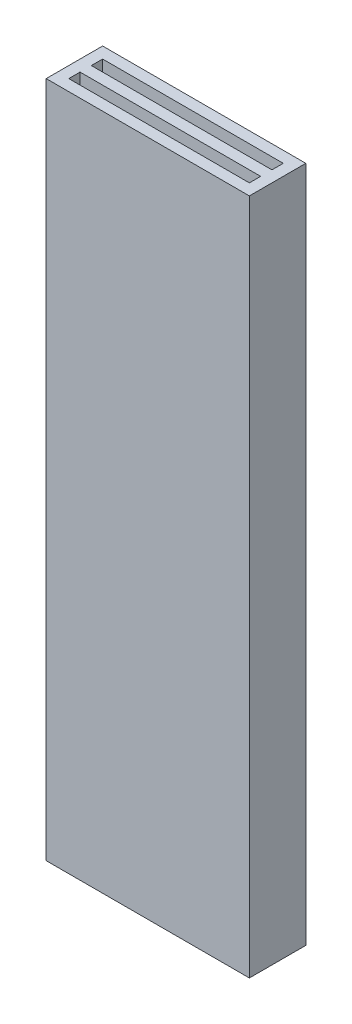
ISO-10303-21;
HEADER;
FILE_DESCRIPTION(('STEP AP214'),'2;1');
FILE_NAME('part.step','',(''),(''),'','','');
FILE_SCHEMA(('AUTOMOTIVE_DESIGN { 1 0 10303 214 1 1 1 1 }'));
ENDSEC;
DATA;
#1=APPLICATION_CONTEXT('core data for automotive mechanical design processes');
#2=APPLICATION_PROTOCOL_DEFINITION('international standard','automotive_design',2000,#1);
#3=PRODUCT_CONTEXT('',#1,'mechanical');
#4=PRODUCT('Part','Part','',(#3));
#5=PRODUCT_RELATED_PRODUCT_CATEGORY('part','',(#4));
#6=PRODUCT_DEFINITION_FORMATION('','',#4);
#7=PRODUCT_DEFINITION_CONTEXT('part definition',#1,'design');
#8=PRODUCT_DEFINITION('design','',#6,#7);
#9=PRODUCT_DEFINITION_SHAPE('','',#8);
#10=(LENGTH_UNIT() NAMED_UNIT(*) SI_UNIT(.MILLI.,.METRE.));
#11=(NAMED_UNIT(*) PLANE_ANGLE_UNIT() SI_UNIT($,.RADIAN.));
#12=(NAMED_UNIT(*) SI_UNIT($,.STERADIAN.) SOLID_ANGLE_UNIT());
#13=UNCERTAINTY_MEASURE_WITH_UNIT(LENGTH_MEASURE(1.E-05),#10,'distance_accuracy_value','');
#14=(GEOMETRIC_REPRESENTATION_CONTEXT(3) GLOBAL_UNCERTAINTY_ASSIGNED_CONTEXT((#13)) GLOBAL_UNIT_ASSIGNED_CONTEXT((#10,
#11,#12)) REPRESENTATION_CONTEXT('',''));
#15=CARTESIAN_POINT('',(0.,0.,0.));
#16=DIRECTION('',(0.,0.,1.));
#17=DIRECTION('',(1.,0.,0.));
#18=AXIS2_PLACEMENT_3D('',#15,#16,#17);
#19=CARTESIAN_POINT('',(0.,15.,0.));
#20=DIRECTION('',(0.,-1.,0.));
#21=DIRECTION('',(0.,0.,-1.));
#22=AXIS2_PLACEMENT_3D('',#19,#20,#21);
#23=PLANE('',#22);
#24=DIRECTION('',(0.,0.,-1.));
#25=VECTOR('',#24,1.);
#26=CARTESIAN_POINT('',(4.5,15.,1.25));
#27=LINE('',#26,#25);
#28=CARTESIAN_POINT('',(4.5,15.,1.25));
#29=VERTEX_POINT('',#28);
#30=CARTESIAN_POINT('',(4.5,15.,-1.25));
#31=VERTEX_POINT('',#30);
#32=EDGE_CURVE('E222',#29,#31,#27,.T.);
#33=ORIENTED_EDGE('',*,*,#32,.T.);
#34=DIRECTION('',(-1.,0.,0.));
#35=VECTOR('',#34,1.);
#36=CARTESIAN_POINT('',(-4.5,15.,-1.25));
#37=LINE('',#36,#35);
#38=CARTESIAN_POINT('',(-4.5,15.,-1.25));
#39=VERTEX_POINT('',#38);
#40=EDGE_CURVE('E226',#31,#39,#37,.T.);
#41=ORIENTED_EDGE('',*,*,#40,.T.);
#42=DIRECTION('',(0.,0.,1.));
#43=VECTOR('',#42,1.);
#44=CARTESIAN_POINT('',(-4.5,15.,1.25));
#45=LINE('',#44,#43);
#46=CARTESIAN_POINT('',(-4.5,15.,1.25));
#47=VERTEX_POINT('',#46);
#48=EDGE_CURVE('E230',#39,#47,#45,.T.);
#49=ORIENTED_EDGE('',*,*,#48,.T.);
#50=DIRECTION('',(1.,0.,0.));
#51=VECTOR('',#50,1.);
#52=CARTESIAN_POINT('',(-4.5,15.,1.25));
#53=LINE('',#52,#51);
#54=EDGE_CURVE('E233',#47,#29,#53,.T.);
#55=ORIENTED_EDGE('',*,*,#54,.T.);
#56=EDGE_LOOP('',(#33,#41,#49,#55));
#57=FACE_BOUND('',#56,.T.);
#58=DIRECTION('',(1.,0.,0.));
#59=VECTOR('',#58,1.);
#60=CARTESIAN_POINT('',(0.,15.,-0.75));
#61=LINE('',#60,#59);
#62=CARTESIAN_POINT('',(-4.,15.,-0.75));
#63=VERTEX_POINT('',#62);
#64=CARTESIAN_POINT('',(4.,15.,-0.75));
#65=VERTEX_POINT('',#64);
#66=EDGE_CURVE('E195',#63,#65,#61,.T.);
#67=ORIENTED_EDGE('',*,*,#66,.T.);
#68=DIRECTION('',(0.,0.,1.));
#69=VECTOR('',#68,1.);
#70=CARTESIAN_POINT('',(4.,15.,0.));
#71=LINE('',#70,#69);
#72=CARTESIAN_POINT('',(4.,15.,-0.25));
#73=VERTEX_POINT('',#72);
#74=EDGE_CURVE('E217',#65,#73,#71,.T.);
#75=ORIENTED_EDGE('',*,*,#74,.T.);
#76=DIRECTION('',(-1.,0.,0.));
#77=VECTOR('',#76,1.);
#78=CARTESIAN_POINT('',(0.,15.,-0.25));
#79=LINE('',#78,#77);
#80=CARTESIAN_POINT('',(-4.,15.,-0.25));
#81=VERTEX_POINT('',#80);
#82=EDGE_CURVE('E213',#73,#81,#79,.T.);
#83=ORIENTED_EDGE('',*,*,#82,.T.);
#84=DIRECTION('',(0.,0.,-1.));
#85=VECTOR('',#84,1.);
#86=CARTESIAN_POINT('',(-4.,15.,0.));
#87=LINE('',#86,#85);
#88=EDGE_CURVE('E209',#81,#63,#87,.T.);
#89=ORIENTED_EDGE('',*,*,#88,.T.);
#90=EDGE_LOOP('',(#67,#75,#83,#89));
#91=FACE_BOUND('',#90,.T.);
#92=DIRECTION('',(0.,0.,-1.));
#93=VECTOR('',#92,1.);
#94=CARTESIAN_POINT('',(4.,15.,0.));
#95=LINE('',#94,#93);
#96=CARTESIAN_POINT('',(4.,15.,0.75));
#97=VERTEX_POINT('',#96);
#98=CARTESIAN_POINT('',(4.,15.,0.25));
#99=VERTEX_POINT('',#98);
#100=EDGE_CURVE('E140',#97,#99,#95,.T.);
#101=ORIENTED_EDGE('',*,*,#100,.F.);
#102=DIRECTION('',(1.,0.,0.));
#103=VECTOR('',#102,1.);
#104=CARTESIAN_POINT('',(0.,15.,0.75));
#105=LINE('',#104,#103);
#106=CARTESIAN_POINT('',(-4.,15.,0.75));
#107=VERTEX_POINT('',#106);
#108=EDGE_CURVE('E169',#107,#97,#105,.T.);
#109=ORIENTED_EDGE('',*,*,#108,.F.);
#110=DIRECTION('',(0.,0.,1.));
#111=VECTOR('',#110,1.);
#112=CARTESIAN_POINT('',(-4.,15.,0.));
#113=LINE('',#112,#111);
#114=CARTESIAN_POINT('',(-4.,15.,0.25));
#115=VERTEX_POINT('',#114);
#116=EDGE_CURVE('E166',#115,#107,#113,.T.);
#117=ORIENTED_EDGE('',*,*,#116,.F.);
#118=DIRECTION('',(-1.,0.,0.));
#119=VECTOR('',#118,1.);
#120=CARTESIAN_POINT('',(0.,15.,0.25));
#121=LINE('',#120,#119);
#122=EDGE_CURVE('E157',#99,#115,#121,.T.);
#123=ORIENTED_EDGE('',*,*,#122,.F.);
#124=EDGE_LOOP('',(#101,#109,#117,#123));
#125=FACE_BOUND('',#124,.T.);
#126=ADVANCED_FACE('F39',(#57,#91,#125),#23,.F.);
#127=CARTESIAN_POINT('',(0.,-15.,0.));
#128=DIRECTION('',(0.,-1.,0.));
#129=DIRECTION('',(0.,0.,-1.));
#130=AXIS2_PLACEMENT_3D('',#127,#128,#129);
#131=PLANE('',#130);
#132=DIRECTION('',(0.,0.,-1.));
#133=VECTOR('',#132,1.);
#134=CARTESIAN_POINT('',(4.,-15.,-0.25));
#135=LINE('',#134,#133);
#136=CARTESIAN_POINT('',(4.,-15.,-0.25));
#137=VERTEX_POINT('',#136);
#138=CARTESIAN_POINT('',(4.,-15.,-0.75));
#139=VERTEX_POINT('',#138);
#140=EDGE_CURVE('E174',#137,#139,#135,.T.);
#141=ORIENTED_EDGE('',*,*,#140,.T.);
#142=DIRECTION('',(-1.,0.,0.));
#143=VECTOR('',#142,1.);
#144=CARTESIAN_POINT('',(-4.,-15.,-0.75));
#145=LINE('',#144,#143);
#146=CARTESIAN_POINT('',(-4.,-15.,-0.75));
#147=VERTEX_POINT('',#146);
#148=EDGE_CURVE('E178',#139,#147,#145,.T.);
#149=ORIENTED_EDGE('',*,*,#148,.T.);
#150=DIRECTION('',(0.,0.,1.));
#151=VECTOR('',#150,1.);
#152=CARTESIAN_POINT('',(-4.,-15.,-0.25));
#153=LINE('',#152,#151);
#154=CARTESIAN_POINT('',(-4.,-15.,-0.25));
#155=VERTEX_POINT('',#154);
#156=EDGE_CURVE('E182',#147,#155,#153,.T.);
#157=ORIENTED_EDGE('',*,*,#156,.T.);
#158=DIRECTION('',(1.,0.,0.));
#159=VECTOR('',#158,1.);
#160=CARTESIAN_POINT('',(-4.,-15.,-0.25));
#161=LINE('',#160,#159);
#162=EDGE_CURVE('E186',#155,#137,#161,.T.);
#163=ORIENTED_EDGE('',*,*,#162,.T.);
#164=EDGE_LOOP('',(#141,#149,#157,#163));
#165=FACE_BOUND('',#164,.T.);
#166=DIRECTION('',(0.,0.,-1.));
#167=VECTOR('',#166,1.);
#168=CARTESIAN_POINT('',(4.5,-15.,1.25));
#169=LINE('',#168,#167);
#170=CARTESIAN_POINT('',(4.5,-15.,1.25));
#171=VERTEX_POINT('',#170);
#172=CARTESIAN_POINT('',(4.5,-15.,-1.25));
#173=VERTEX_POINT('',#172);
#174=EDGE_CURVE('E221',#171,#173,#169,.T.);
#175=ORIENTED_EDGE('',*,*,#174,.F.);
#176=DIRECTION('',(1.,0.,0.));
#177=VECTOR('',#176,1.);
#178=CARTESIAN_POINT('',(-4.5,-15.,1.25));
#179=LINE('',#178,#177);
#180=CARTESIAN_POINT('',(-4.5,-15.,1.25));
#181=VERTEX_POINT('',#180);
#182=EDGE_CURVE('E227',#181,#171,#179,.T.);
#183=ORIENTED_EDGE('',*,*,#182,.F.);
#184=DIRECTION('',(0.,0.,1.));
#185=VECTOR('',#184,1.);
#186=CARTESIAN_POINT('',(-4.5,-15.,1.25));
#187=LINE('',#186,#185);
#188=CARTESIAN_POINT('',(-4.5,-15.,-1.25));
#189=VERTEX_POINT('',#188);
#190=EDGE_CURVE('E243',#189,#181,#187,.T.);
#191=ORIENTED_EDGE('',*,*,#190,.F.);
#192=DIRECTION('',(-1.,0.,0.));
#193=VECTOR('',#192,1.);
#194=CARTESIAN_POINT('',(-4.5,-15.,-1.25));
#195=LINE('',#194,#193);
#196=EDGE_CURVE('E240',#173,#189,#195,.T.);
#197=ORIENTED_EDGE('',*,*,#196,.F.);
#198=EDGE_LOOP('',(#175,#183,#191,#197));
#199=FACE_BOUND('',#198,.T.);
#200=DIRECTION('',(-1.,0.,0.));
#201=VECTOR('',#200,1.);
#202=CARTESIAN_POINT('',(-4.,-15.,0.75));
#203=LINE('',#202,#201);
#204=CARTESIAN_POINT('',(4.,-15.,0.75));
#205=VERTEX_POINT('',#204);
#206=CARTESIAN_POINT('',(-4.,-15.,0.75));
#207=VERTEX_POINT('',#206);
#208=EDGE_CURVE('E143',#205,#207,#203,.T.);
#209=ORIENTED_EDGE('',*,*,#208,.F.);
#210=DIRECTION('',(0.,0.,1.));
#211=VECTOR('',#210,1.);
#212=CARTESIAN_POINT('',(4.,-15.,0.25));
#213=LINE('',#212,#211);
#214=CARTESIAN_POINT('',(4.,-15.,0.25));
#215=VERTEX_POINT('',#214);
#216=EDGE_CURVE('E133',#215,#205,#213,.T.);
#217=ORIENTED_EDGE('',*,*,#216,.F.);
#218=DIRECTION('',(1.,0.,0.));
#219=VECTOR('',#218,1.);
#220=CARTESIAN_POINT('',(-4.,-15.,0.25));
#221=LINE('',#220,#219);
#222=CARTESIAN_POINT('',(-4.,-15.,0.25));
#223=VERTEX_POINT('',#222);
#224=EDGE_CURVE('E126',#223,#215,#221,.T.);
#225=ORIENTED_EDGE('',*,*,#224,.F.);
#226=DIRECTION('',(0.,0.,-1.));
#227=VECTOR('',#226,1.);
#228=CARTESIAN_POINT('',(-4.,-15.,0.25));
#229=LINE('',#228,#227);
#230=EDGE_CURVE('E132',#207,#223,#229,.T.);
#231=ORIENTED_EDGE('',*,*,#230,.F.);
#232=EDGE_LOOP('',(#209,#217,#225,#231));
#233=FACE_BOUND('',#232,.T.);
#234=ADVANCED_FACE('F146',(#165,#199,#233),#131,.T.);
#235=CARTESIAN_POINT('',(4.5,15.,1.25));
#236=DIRECTION('',(-1.,0.,0.));
#237=DIRECTION('',(0.,0.,1.));
#238=AXIS2_PLACEMENT_3D('',#235,#236,#237);
#239=PLANE('',#238);
#240=ORIENTED_EDGE('',*,*,#174,.T.);
#241=DIRECTION('',(0.,-1.,0.));
#242=VECTOR('',#241,1.);
#243=CARTESIAN_POINT('',(4.5,15.,-1.25));
#244=LINE('',#243,#242);
#245=EDGE_CURVE('E11',#31,#173,#244,.T.);
#246=ORIENTED_EDGE('',*,*,#245,.F.);
#247=ORIENTED_EDGE('',*,*,#32,.F.);
#248=DIRECTION('',(0.,-1.,0.));
#249=VECTOR('',#248,1.);
#250=CARTESIAN_POINT('',(4.5,15.,1.25));
#251=LINE('',#250,#249);
#252=EDGE_CURVE('E236',#29,#171,#251,.T.);
#253=ORIENTED_EDGE('',*,*,#252,.T.);
#254=EDGE_LOOP('',(#240,#246,#247,#253));
#255=FACE_BOUND('',#254,.T.);
#256=ADVANCED_FACE('F41',(#255),#239,.F.);
#257=CARTESIAN_POINT('',(-4.5,15.,-1.25));
#258=DIRECTION('',(0.,0.,1.));
#259=DIRECTION('',(1.,0.,0.));
#260=AXIS2_PLACEMENT_3D('',#257,#258,#259);
#261=PLANE('',#260);
#262=ORIENTED_EDGE('',*,*,#196,.T.);
#263=DIRECTION('',(0.,-1.,0.));
#264=VECTOR('',#263,1.);
#265=CARTESIAN_POINT('',(-4.5,15.,-1.25));
#266=LINE('',#265,#264);
#267=EDGE_CURVE('E48',#39,#189,#266,.T.);
#268=ORIENTED_EDGE('',*,*,#267,.F.);
#269=ORIENTED_EDGE('',*,*,#40,.F.);
#270=ORIENTED_EDGE('',*,*,#245,.T.);
#271=EDGE_LOOP('',(#262,#268,#269,#270));
#272=FACE_BOUND('',#271,.T.);
#273=ADVANCED_FACE('F275',(#272),#261,.F.);
#274=CARTESIAN_POINT('',(-4.5,15.,1.25));
#275=DIRECTION('',(1.,0.,0.));
#276=DIRECTION('',(0.,0.,-1.));
#277=AXIS2_PLACEMENT_3D('',#274,#275,#276);
#278=PLANE('',#277);
#279=ORIENTED_EDGE('',*,*,#190,.T.);
#280=DIRECTION('',(0.,-1.,0.));
#281=VECTOR('',#280,1.);
#282=CARTESIAN_POINT('',(-4.5,15.,1.25));
#283=LINE('',#282,#281);
#284=EDGE_CURVE('E251',#47,#181,#283,.T.);
#285=ORIENTED_EDGE('',*,*,#284,.F.);
#286=ORIENTED_EDGE('',*,*,#48,.F.);
#287=ORIENTED_EDGE('',*,*,#267,.T.);
#288=EDGE_LOOP('',(#279,#285,#286,#287));
#289=FACE_BOUND('',#288,.T.);
#290=ADVANCED_FACE('F260',(#289),#278,.F.);
#291=CARTESIAN_POINT('',(-4.5,15.,1.25));
#292=DIRECTION('',(0.,0.,-1.));
#293=DIRECTION('',(-1.,0.,0.));
#294=AXIS2_PLACEMENT_3D('',#291,#292,#293);
#295=PLANE('',#294);
#296=ORIENTED_EDGE('',*,*,#182,.T.);
#297=ORIENTED_EDGE('',*,*,#252,.F.);
#298=ORIENTED_EDGE('',*,*,#54,.F.);
#299=ORIENTED_EDGE('',*,*,#284,.T.);
#300=EDGE_LOOP('',(#296,#297,#298,#299));
#301=FACE_BOUND('',#300,.T.);
#302=ADVANCED_FACE('F268',(#301),#295,.F.);
#303=CARTESIAN_POINT('',(4.,-15.,-0.25));
#304=DIRECTION('',(1.,0.,0.));
#305=DIRECTION('',(0.,0.,-1.));
#306=AXIS2_PLACEMENT_3D('',#303,#304,#305);
#307=PLANE('',#306);
#308=DIRECTION('',(0.,1.,0.));
#309=VECTOR('',#308,1.);
#310=CARTESIAN_POINT('',(4.,-15.,-0.75));
#311=LINE('',#310,#309);
#312=EDGE_CURVE('E190',#139,#65,#311,.T.);
#313=ORIENTED_EDGE('',*,*,#312,.F.);
#314=ORIENTED_EDGE('',*,*,#140,.F.);
#315=DIRECTION('',(0.,1.,0.));
#316=VECTOR('',#315,1.);
#317=CARTESIAN_POINT('',(4.,-15.,-0.25));
#318=LINE('',#317,#316);
#319=EDGE_CURVE('E191',#137,#73,#318,.T.);
#320=ORIENTED_EDGE('',*,*,#319,.T.);
#321=ORIENTED_EDGE('',*,*,#74,.F.);
#322=EDGE_LOOP('',(#313,#314,#320,#321));
#323=FACE_BOUND('',#322,.T.);
#324=ADVANCED_FACE('F290',(#323),#307,.F.);
#325=CARTESIAN_POINT('',(-4.,-15.,-0.25));
#326=DIRECTION('',(0.,0.,1.));
#327=DIRECTION('',(1.,0.,0.));
#328=AXIS2_PLACEMENT_3D('',#325,#326,#327);
#329=PLANE('',#328);
#330=ORIENTED_EDGE('',*,*,#319,.F.);
#331=ORIENTED_EDGE('',*,*,#162,.F.);
#332=DIRECTION('',(0.,1.,0.));
#333=VECTOR('',#332,1.);
#334=CARTESIAN_POINT('',(-4.,-15.,-0.25));
#335=LINE('',#334,#333);
#336=EDGE_CURVE('E196',#155,#81,#335,.T.);
#337=ORIENTED_EDGE('',*,*,#336,.T.);
#338=ORIENTED_EDGE('',*,*,#82,.F.);
#339=EDGE_LOOP('',(#330,#331,#337,#338));
#340=FACE_BOUND('',#339,.T.);
#341=ADVANCED_FACE('F297',(#340),#329,.F.);
#342=CARTESIAN_POINT('',(-4.,-15.,-0.25));
#343=DIRECTION('',(-1.,0.,0.));
#344=DIRECTION('',(0.,0.,1.));
#345=AXIS2_PLACEMENT_3D('',#342,#343,#344);
#346=PLANE('',#345);
#347=ORIENTED_EDGE('',*,*,#336,.F.);
#348=ORIENTED_EDGE('',*,*,#156,.F.);
#349=DIRECTION('',(0.,1.,0.));
#350=VECTOR('',#349,1.);
#351=CARTESIAN_POINT('',(-4.,-15.,-0.75));
#352=LINE('',#351,#350);
#353=EDGE_CURVE('E200',#147,#63,#352,.T.);
#354=ORIENTED_EDGE('',*,*,#353,.T.);
#355=ORIENTED_EDGE('',*,*,#88,.F.);
#356=EDGE_LOOP('',(#347,#348,#354,#355));
#357=FACE_BOUND('',#356,.T.);
#358=ADVANCED_FACE('F302',(#357),#346,.F.);
#359=CARTESIAN_POINT('',(-4.,-15.,-0.75));
#360=DIRECTION('',(0.,0.,-1.));
#361=DIRECTION('',(-1.,0.,0.));
#362=AXIS2_PLACEMENT_3D('',#359,#360,#361);
#363=PLANE('',#362);
#364=ORIENTED_EDGE('',*,*,#353,.F.);
#365=ORIENTED_EDGE('',*,*,#148,.F.);
#366=ORIENTED_EDGE('',*,*,#312,.T.);
#367=ORIENTED_EDGE('',*,*,#66,.F.);
#368=EDGE_LOOP('',(#364,#365,#366,#367));
#369=FACE_BOUND('',#368,.T.);
#370=ADVANCED_FACE('F310',(#369),#363,.F.);
#371=CARTESIAN_POINT('',(4.,-15.,0.25));
#372=DIRECTION('',(-1.,0.,0.));
#373=DIRECTION('',(0.,0.,1.));
#374=AXIS2_PLACEMENT_3D('',#371,#372,#373);
#375=PLANE('',#374);
#376=ORIENTED_EDGE('',*,*,#100,.T.);
#377=DIRECTION('',(0.,1.,0.));
#378=VECTOR('',#377,1.);
#379=CARTESIAN_POINT('',(4.,-15.,0.25));
#380=LINE('',#379,#378);
#381=EDGE_CURVE('E55',#215,#99,#380,.T.);
#382=ORIENTED_EDGE('',*,*,#381,.F.);
#383=ORIENTED_EDGE('',*,*,#216,.T.);
#384=DIRECTION('',(0.,1.,0.));
#385=VECTOR('',#384,1.);
#386=CARTESIAN_POINT('',(4.,-15.,0.75));
#387=LINE('',#386,#385);
#388=EDGE_CURVE('E154',#205,#97,#387,.T.);
#389=ORIENTED_EDGE('',*,*,#388,.T.);
#390=EDGE_LOOP('',(#376,#382,#383,#389));
#391=FACE_BOUND('',#390,.T.);
#392=ADVANCED_FACE('F136',(#391),#375,.T.);
#393=CARTESIAN_POINT('',(-4.,-15.,0.75));
#394=DIRECTION('',(0.,0.,-1.));
#395=DIRECTION('',(-1.,0.,0.));
#396=AXIS2_PLACEMENT_3D('',#393,#394,#395);
#397=PLANE('',#396);
#398=ORIENTED_EDGE('',*,*,#108,.T.);
#399=ORIENTED_EDGE('',*,*,#388,.F.);
#400=ORIENTED_EDGE('',*,*,#208,.T.);
#401=DIRECTION('',(0.,1.,0.));
#402=VECTOR('',#401,1.);
#403=CARTESIAN_POINT('',(-4.,-15.,0.75));
#404=LINE('',#403,#402);
#405=EDGE_CURVE('E158',#207,#107,#404,.T.);
#406=ORIENTED_EDGE('',*,*,#405,.T.);
#407=EDGE_LOOP('',(#398,#399,#400,#406));
#408=FACE_BOUND('',#407,.T.);
#409=ADVANCED_FACE('F322',(#408),#397,.T.);
#410=CARTESIAN_POINT('',(-4.,-15.,0.25));
#411=DIRECTION('',(1.,0.,0.));
#412=DIRECTION('',(0.,0.,-1.));
#413=AXIS2_PLACEMENT_3D('',#410,#411,#412);
#414=PLANE('',#413);
#415=ORIENTED_EDGE('',*,*,#116,.T.);
#416=ORIENTED_EDGE('',*,*,#405,.F.);
#417=ORIENTED_EDGE('',*,*,#230,.T.);
#418=DIRECTION('',(0.,1.,0.));
#419=VECTOR('',#418,1.);
#420=CARTESIAN_POINT('',(-4.,-15.,0.25));
#421=LINE('',#420,#419);
#422=EDGE_CURVE('E60',#223,#115,#421,.T.);
#423=ORIENTED_EDGE('',*,*,#422,.T.);
#424=EDGE_LOOP('',(#415,#416,#417,#423));
#425=FACE_BOUND('',#424,.T.);
#426=ADVANCED_FACE('F325',(#425),#414,.T.);
#427=CARTESIAN_POINT('',(-4.,-15.,0.25));
#428=DIRECTION('',(0.,0.,1.));
#429=DIRECTION('',(1.,0.,0.));
#430=AXIS2_PLACEMENT_3D('',#427,#428,#429);
#431=PLANE('',#430);
#432=ORIENTED_EDGE('',*,*,#122,.T.);
#433=ORIENTED_EDGE('',*,*,#422,.F.);
#434=ORIENTED_EDGE('',*,*,#224,.T.);
#435=ORIENTED_EDGE('',*,*,#381,.T.);
#436=EDGE_LOOP('',(#432,#433,#434,#435));
#437=FACE_BOUND('',#436,.T.);
#438=ADVANCED_FACE('F127',(#437),#431,.T.);
#439=CLOSED_SHELL('',(#126,#234,#256,#273,#290,#302,#324,#341,#358,#370,#392,#409,#426,#438));
#440=MANIFOLD_SOLID_BREP('B2',#439);
#441=ADVANCED_BREP_SHAPE_REPRESENTATION('',(#18,#440),#14);
#442=SHAPE_DEFINITION_REPRESENTATION(#9,#441);
ENDSEC;
END-ISO-10303-21;
